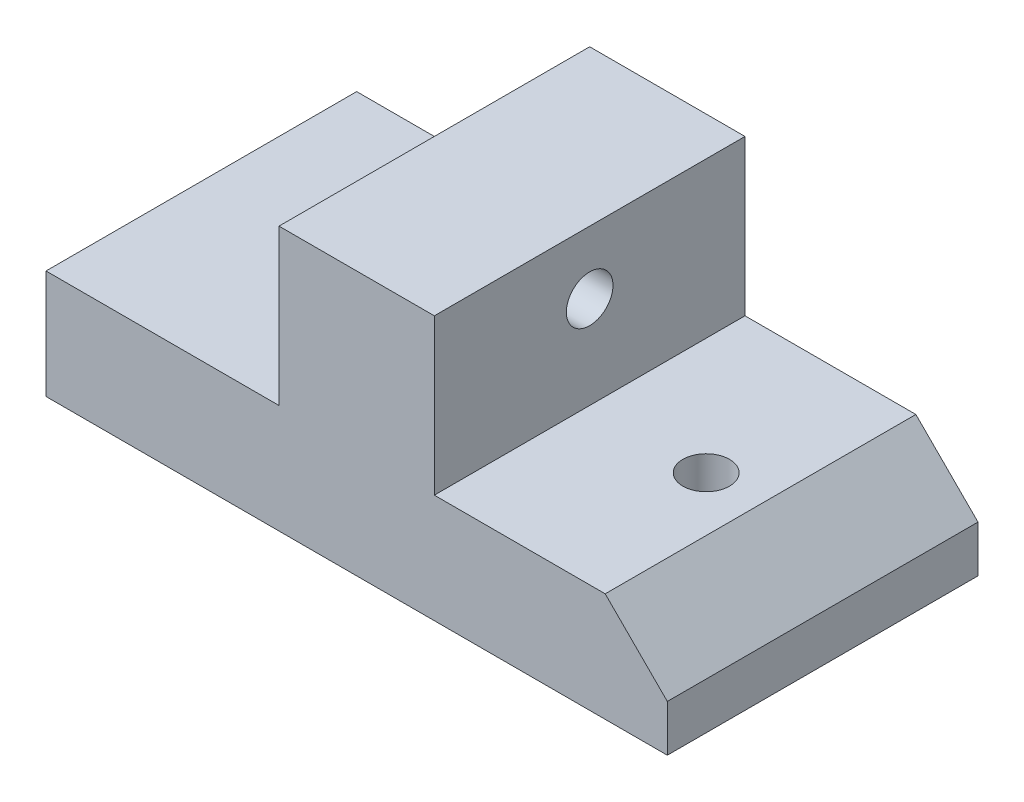
ISO-10303-21;
HEADER;
FILE_DESCRIPTION(('STEP AP214'),'2;1');
FILE_NAME('part.step','',(''),(''),'','','');
FILE_SCHEMA(('AUTOMOTIVE_DESIGN { 1 0 10303 214 1 1 1 1 }'));
ENDSEC;
DATA;
#1=APPLICATION_CONTEXT('core data for automotive mechanical design processes');
#2=APPLICATION_PROTOCOL_DEFINITION('international standard','automotive_design',2000,#1);
#3=PRODUCT_CONTEXT('',#1,'mechanical');
#4=PRODUCT('Part','Part','',(#3));
#5=PRODUCT_RELATED_PRODUCT_CATEGORY('part','',(#4));
#6=PRODUCT_DEFINITION_FORMATION('','',#4);
#7=PRODUCT_DEFINITION_CONTEXT('part definition',#1,'design');
#8=PRODUCT_DEFINITION('design','',#6,#7);
#9=PRODUCT_DEFINITION_SHAPE('','',#8);
#10=(LENGTH_UNIT() NAMED_UNIT(*) SI_UNIT(.MILLI.,.METRE.));
#11=(NAMED_UNIT(*) PLANE_ANGLE_UNIT() SI_UNIT($,.RADIAN.));
#12=(NAMED_UNIT(*) SI_UNIT($,.STERADIAN.) SOLID_ANGLE_UNIT());
#13=UNCERTAINTY_MEASURE_WITH_UNIT(LENGTH_MEASURE(1.E-05),#10,'distance_accuracy_value','');
#14=(GEOMETRIC_REPRESENTATION_CONTEXT(3) GLOBAL_UNCERTAINTY_ASSIGNED_CONTEXT((#13)) GLOBAL_UNIT_ASSIGNED_CONTEXT((#10,
#11,#12)) REPRESENTATION_CONTEXT('',''));
#15=CARTESIAN_POINT('',(0.,0.,0.));
#16=DIRECTION('',(0.,0.,1.));
#17=DIRECTION('',(1.,0.,0.));
#18=AXIS2_PLACEMENT_3D('',#15,#16,#17);
#19=CARTESIAN_POINT('',(-34.4732902548026,4.,8.91666201209773));
#20=DIRECTION('',(0.,0.,-1.));
#21=DIRECTION('',(-1.,0.,0.));
#22=AXIS2_PLACEMENT_3D('',#19,#20,#21);
#23=PLANE('',#22);
#24=DIRECTION('',(-1.,0.,0.));
#25=VECTOR('',#24,1.);
#26=CARTESIAN_POINT('',(-34.4732902548026,-3.,8.91666201209773));
#27=LINE('',#26,#25);
#28=CARTESIAN_POINT('',(5.52670974519742,-3.,8.91666201209773));
#29=VERTEX_POINT('',#28);
#30=CARTESIAN_POINT('',(-34.4732902548026,-3.,8.91666201209773));
#31=VERTEX_POINT('',#30);
#32=EDGE_CURVE('E114',#29,#31,#27,.T.);
#33=ORIENTED_EDGE('',*,*,#32,.F.);
#34=DIRECTION('',(0.,1.,0.));
#35=VECTOR('',#34,1.);
#36=CARTESIAN_POINT('',(5.52670974519742,-4.5,8.91666201209773));
#37=LINE('',#36,#35);
#38=CARTESIAN_POINT('',(5.52670974519742,0.,8.91666201209773));
#39=VERTEX_POINT('',#38);
#40=EDGE_CURVE('E204',#29,#39,#37,.T.);
#41=ORIENTED_EDGE('',*,*,#40,.T.);
#42=DIRECTION('',(-0.707106781186548,0.707106781186548,0.));
#43=VECTOR('',#42,1.);
#44=CARTESIAN_POINT('',(1.52670974519742,4.,8.91666201209773));
#45=LINE('',#44,#43);
#46=CARTESIAN_POINT('',(1.52670974519743,4.,8.91666201209773));
#47=VERTEX_POINT('',#46);
#48=EDGE_CURVE('E63',#39,#47,#45,.T.);
#49=ORIENTED_EDGE('',*,*,#48,.T.);
#50=DIRECTION('',(1.,0.,0.));
#51=VECTOR('',#50,1.);
#52=CARTESIAN_POINT('',(-34.4732902548026,4.,8.91666201209773));
#53=LINE('',#52,#51);
#54=CARTESIAN_POINT('',(-9.47329025480258,4.,8.91666201209773));
#55=VERTEX_POINT('',#54);
#56=EDGE_CURVE('E149',#55,#47,#53,.T.);
#57=ORIENTED_EDGE('',*,*,#56,.F.);
#58=DIRECTION('',(0.,-1.,0.));
#59=VECTOR('',#58,1.);
#60=CARTESIAN_POINT('',(-9.47329025480258,14.,8.91666201209773));
#61=LINE('',#60,#59);
#62=CARTESIAN_POINT('',(-9.47329025480258,14.,8.91666201209773));
#63=VERTEX_POINT('',#62);
#64=EDGE_CURVE('E143',#63,#55,#61,.T.);
#65=ORIENTED_EDGE('',*,*,#64,.F.);
#66=DIRECTION('',(1.,0.,0.));
#67=VECTOR('',#66,1.);
#68=CARTESIAN_POINT('',(-19.4732902548026,14.,8.91666201209773));
#69=LINE('',#68,#67);
#70=CARTESIAN_POINT('',(-19.4732902548026,14.,8.91666201209773));
#71=VERTEX_POINT('',#70);
#72=EDGE_CURVE('E169',#71,#63,#69,.T.);
#73=ORIENTED_EDGE('',*,*,#72,.F.);
#74=DIRECTION('',(0.,-1.,0.));
#75=VECTOR('',#74,1.);
#76=CARTESIAN_POINT('',(-19.4732902548026,14.,8.91666201209773));
#77=LINE('',#76,#75);
#78=CARTESIAN_POINT('',(-19.4732902548026,4.,8.91666201209773));
#79=VERTEX_POINT('',#78);
#80=EDGE_CURVE('E161',#71,#79,#77,.T.);
#81=ORIENTED_EDGE('',*,*,#80,.T.);
#82=CARTESIAN_POINT('',(-34.4732902548026,4.,8.91666201209773));
#83=VERTEX_POINT('',#82);
#84=EDGE_CURVE('E145',#83,#79,#53,.T.);
#85=ORIENTED_EDGE('',*,*,#84,.F.);
#86=DIRECTION('',(0.,-1.,0.));
#87=VECTOR('',#86,1.);
#88=CARTESIAN_POINT('',(-34.4732902548026,4.,8.91666201209773));
#89=LINE('',#88,#87);
#90=EDGE_CURVE('E11',#83,#31,#89,.T.);
#91=ORIENTED_EDGE('',*,*,#90,.T.);
#92=EDGE_LOOP('',(#33,#41,#49,#57,#65,#73,#81,#85,#91));
#93=FACE_BOUND('',#92,.T.);
#94=ADVANCED_FACE('F38',(#93),#23,.F.);
#95=CARTESIAN_POINT('',(-34.4732902548026,4.,-11.0833379879023));
#96=DIRECTION('',(0.,0.,1.));
#97=DIRECTION('',(1.,0.,0.));
#98=AXIS2_PLACEMENT_3D('',#95,#96,#97);
#99=PLANE('',#98);
#100=DIRECTION('',(1.,0.,0.));
#101=VECTOR('',#100,1.);
#102=CARTESIAN_POINT('',(-34.4732902548026,-3.,-11.0833379879023));
#103=LINE('',#102,#101);
#104=CARTESIAN_POINT('',(-34.4732902548026,-3.,-11.0833379879023));
#105=VERTEX_POINT('',#104);
#106=CARTESIAN_POINT('',(5.52670974519742,-3.,-11.0833379879023));
#107=VERTEX_POINT('',#106);
#108=EDGE_CURVE('E55',#105,#107,#103,.T.);
#109=ORIENTED_EDGE('',*,*,#108,.F.);
#110=DIRECTION('',(0.,-1.,0.));
#111=VECTOR('',#110,1.);
#112=CARTESIAN_POINT('',(-34.4732902548026,4.,-11.0833379879023));
#113=LINE('',#112,#111);
#114=CARTESIAN_POINT('',(-34.4732902548026,4.,-11.0833379879023));
#115=VERTEX_POINT('',#114);
#116=EDGE_CURVE('E48',#115,#105,#113,.T.);
#117=ORIENTED_EDGE('',*,*,#116,.F.);
#118=DIRECTION('',(-1.,0.,0.));
#119=VECTOR('',#118,1.);
#120=CARTESIAN_POINT('',(-34.4732902548026,4.,-11.0833379879023));
#121=LINE('',#120,#119);
#122=CARTESIAN_POINT('',(-19.4732902548026,4.,-11.0833379879023));
#123=VERTEX_POINT('',#122);
#124=EDGE_CURVE('E137',#123,#115,#121,.T.);
#125=ORIENTED_EDGE('',*,*,#124,.F.);
#126=DIRECTION('',(0.,-1.,0.));
#127=VECTOR('',#126,1.);
#128=CARTESIAN_POINT('',(-19.4732902548026,14.,-11.0833379879023));
#129=LINE('',#128,#127);
#130=CARTESIAN_POINT('',(-19.4732902548026,14.,-11.0833379879023));
#131=VERTEX_POINT('',#130);
#132=EDGE_CURVE('E158',#131,#123,#129,.T.);
#133=ORIENTED_EDGE('',*,*,#132,.F.);
#134=DIRECTION('',(1.,0.,0.));
#135=VECTOR('',#134,1.);
#136=CARTESIAN_POINT('',(-19.4732902548026,14.,-11.0833379879023));
#137=LINE('',#136,#135);
#138=CARTESIAN_POINT('',(-9.47329025480258,14.,-11.0833379879023));
#139=VERTEX_POINT('',#138);
#140=EDGE_CURVE('E176',#131,#139,#137,.T.);
#141=ORIENTED_EDGE('',*,*,#140,.T.);
#142=DIRECTION('',(0.,-1.,0.));
#143=VECTOR('',#142,1.);
#144=CARTESIAN_POINT('',(-9.47329025480258,14.,-11.0833379879023));
#145=LINE('',#144,#143);
#146=CARTESIAN_POINT('',(-9.47329025480258,4.,-11.0833379879023));
#147=VERTEX_POINT('',#146);
#148=EDGE_CURVE('E154',#139,#147,#145,.T.);
#149=ORIENTED_EDGE('',*,*,#148,.T.);
#150=CARTESIAN_POINT('',(1.52670974519742,4.,-11.0833379879023));
#151=VERTEX_POINT('',#150);
#152=EDGE_CURVE('E134',#151,#147,#121,.T.);
#153=ORIENTED_EDGE('',*,*,#152,.F.);
#154=DIRECTION('',(-0.707106781186548,0.707106781186548,0.));
#155=VECTOR('',#154,1.);
#156=CARTESIAN_POINT('',(1.52670974519742,4.,-11.0833379879023));
#157=LINE('',#156,#155);
#158=CARTESIAN_POINT('',(5.52670974519742,0.,-11.0833379879023));
#159=VERTEX_POINT('',#158);
#160=EDGE_CURVE('E201',#159,#151,#157,.T.);
#161=ORIENTED_EDGE('',*,*,#160,.F.);
#162=DIRECTION('',(0.,1.,0.));
#163=VECTOR('',#162,1.);
#164=CARTESIAN_POINT('',(5.52670974519742,-4.5,-11.0833379879023));
#165=LINE('',#164,#163);
#166=EDGE_CURVE('E127',#107,#159,#165,.T.);
#167=ORIENTED_EDGE('',*,*,#166,.F.);
#168=EDGE_LOOP('',(#109,#117,#125,#133,#141,#149,#153,#161,#167));
#169=FACE_BOUND('',#168,.T.);
#170=ADVANCED_FACE('F123',(#169),#99,.F.);
#171=CARTESIAN_POINT('',(-34.4732902548026,4.,-11.0833379879023));
#172=DIRECTION('',(1.,0.,0.));
#173=DIRECTION('',(0.,0.,-1.));
#174=AXIS2_PLACEMENT_3D('',#171,#172,#173);
#175=PLANE('',#174);
#176=DIRECTION('',(0.,0.,-1.));
#177=VECTOR('',#176,1.);
#178=CARTESIAN_POINT('',(-34.4732902548026,-3.,8.91666201209773));
#179=LINE('',#178,#177);
#180=EDGE_CURVE('E110',#31,#105,#179,.T.);
#181=ORIENTED_EDGE('',*,*,#180,.F.);
#182=ORIENTED_EDGE('',*,*,#90,.F.);
#183=DIRECTION('',(0.,0.,1.));
#184=VECTOR('',#183,1.);
#185=CARTESIAN_POINT('',(-34.4732902548026,4.,-11.0833379879023));
#186=LINE('',#185,#184);
#187=EDGE_CURVE('E132',#115,#83,#186,.T.);
#188=ORIENTED_EDGE('',*,*,#187,.F.);
#189=ORIENTED_EDGE('',*,*,#116,.T.);
#190=EDGE_LOOP('',(#181,#182,#188,#189));
#191=FACE_BOUND('',#190,.T.);
#192=ADVANCED_FACE('F40',(#191),#175,.F.);
#193=CARTESIAN_POINT('',(-26.9732902548026,-16.,-1.08333798790227));
#194=DIRECTION('',(0.,1.,0.));
#195=DIRECTION('',(0.,0.,1.));
#196=AXIS2_PLACEMENT_3D('',#193,#194,#195);
#197=CYLINDRICAL_SURFACE('',#196,1.5);
#198=CARTESIAN_POINT('',(-26.9732902548026,4.,-1.08333798790227));
#199=DIRECTION('',(0.,1.,0.));
#200=DIRECTION('',(0.,0.,1.));
#201=AXIS2_PLACEMENT_3D('',#198,#199,#200);
#202=CIRCLE('',#201,1.5);
#203=CARTESIAN_POINT('',(-26.9732902548026,4.,0.416662012097734));
#204=VERTEX_POINT('',#203);
#205=EDGE_CURVE('E191',#204,#204,#202,.T.);
#206=ORIENTED_EDGE('',*,*,#205,.T.);
#207=EDGE_LOOP('',(#206));
#208=FACE_BOUND('',#207,.T.);
#209=CARTESIAN_POINT('',(-26.9732902548026,-3.,-1.08333798790227));
#210=DIRECTION('',(0.,-1.,0.));
#211=DIRECTION('',(0.,0.,-1.));
#212=AXIS2_PLACEMENT_3D('',#209,#210,#211);
#213=CIRCLE('',#212,1.5);
#214=CARTESIAN_POINT('',(-26.9732902548026,-3.,-2.58333798790227));
#215=VERTEX_POINT('',#214);
#216=EDGE_CURVE('E212',#215,#215,#213,.F.);
#217=ORIENTED_EDGE('',*,*,#216,.F.);
#218=EDGE_LOOP('',(#217));
#219=FACE_BOUND('',#218,.T.);
#220=ADVANCED_FACE('F338',(#208,#219),#197,.F.);
#221=CARTESIAN_POINT('',(-1.97329025480258,-16.,-1.08333798790227));
#222=DIRECTION('',(0.,1.,0.));
#223=DIRECTION('',(0.,0.,1.));
#224=AXIS2_PLACEMENT_3D('',#221,#222,#223);
#225=CYLINDRICAL_SURFACE('',#224,1.5);
#226=CARTESIAN_POINT('',(-1.97329025480258,4.,-1.08333798790227));
#227=DIRECTION('',(0.,1.,0.));
#228=DIRECTION('',(0.,0.,1.));
#229=AXIS2_PLACEMENT_3D('',#226,#227,#228);
#230=CIRCLE('',#229,1.5);
#231=CARTESIAN_POINT('',(-1.97329025480258,4.,0.416662012097733));
#232=VERTEX_POINT('',#231);
#233=EDGE_CURVE('E190',#232,#232,#230,.T.);
#234=ORIENTED_EDGE('',*,*,#233,.T.);
#235=EDGE_LOOP('',(#234));
#236=FACE_BOUND('',#235,.T.);
#237=CARTESIAN_POINT('',(-1.97329025480258,-3.,-1.08333798790227));
#238=DIRECTION('',(0.,-1.,0.));
#239=DIRECTION('',(0.,0.,-1.));
#240=AXIS2_PLACEMENT_3D('',#237,#238,#239);
#241=CIRCLE('',#240,1.5);
#242=CARTESIAN_POINT('',(-1.97329025480258,-3.,-2.58333798790227));
#243=VERTEX_POINT('',#242);
#244=EDGE_CURVE('E216',#243,#243,#241,.F.);
#245=ORIENTED_EDGE('',*,*,#244,.F.);
#246=EDGE_LOOP('',(#245));
#247=FACE_BOUND('',#246,.T.);
#248=ADVANCED_FACE('F348',(#236,#247),#225,.F.);
#249=CARTESIAN_POINT('',(5.52670974519742,-4.5,8.91666201209773));
#250=DIRECTION('',(-1.,0.,0.));
#251=DIRECTION('',(0.,0.,1.));
#252=AXIS2_PLACEMENT_3D('',#249,#250,#251);
#253=PLANE('',#252);
#254=DIRECTION('',(0.,0.,1.));
#255=VECTOR('',#254,1.);
#256=CARTESIAN_POINT('',(5.52670974519742,-3.,8.91666201209773));
#257=LINE('',#256,#255);
#258=EDGE_CURVE('E129',#107,#29,#257,.T.);
#259=ORIENTED_EDGE('',*,*,#258,.F.);
#260=ORIENTED_EDGE('',*,*,#166,.T.);
#261=DIRECTION('',(0.,0.,-1.));
#262=VECTOR('',#261,1.);
#263=CARTESIAN_POINT('',(5.52670974519742,0.,-11.0833379879023));
#264=LINE('',#263,#262);
#265=EDGE_CURVE('E140',#39,#159,#264,.T.);
#266=ORIENTED_EDGE('',*,*,#265,.F.);
#267=ORIENTED_EDGE('',*,*,#40,.F.);
#268=EDGE_LOOP('',(#259,#260,#266,#267));
#269=FACE_BOUND('',#268,.T.);
#270=ADVANCED_FACE('F226',(#269),#253,.F.);
#271=CARTESIAN_POINT('',(0.,4.,0.));
#272=DIRECTION('',(0.,1.,0.));
#273=DIRECTION('',(0.,0.,1.));
#274=AXIS2_PLACEMENT_3D('',#271,#272,#273);
#275=PLANE('',#274);
#276=ORIENTED_EDGE('',*,*,#233,.F.);
#277=EDGE_LOOP('',(#276));
#278=FACE_BOUND('',#277,.T.);
#279=ORIENTED_EDGE('',*,*,#56,.T.);
#280=DIRECTION('',(0.,0.,-1.));
#281=VECTOR('',#280,1.);
#282=CARTESIAN_POINT('',(1.52670974519742,4.,92.4935345813976));
#283=LINE('',#282,#281);
#284=EDGE_CURVE('E195',#47,#151,#283,.T.);
#285=ORIENTED_EDGE('',*,*,#284,.T.);
#286=ORIENTED_EDGE('',*,*,#152,.T.);
#287=DIRECTION('',(0.,0.,1.));
#288=VECTOR('',#287,1.);
#289=CARTESIAN_POINT('',(-9.47329025480258,4.,-11.0833379879023));
#290=LINE('',#289,#288);
#291=EDGE_CURVE('E170',#147,#55,#290,.T.);
#292=ORIENTED_EDGE('',*,*,#291,.T.);
#293=EDGE_LOOP('',(#279,#285,#286,#292));
#294=FACE_BOUND('',#293,.T.);
#295=ADVANCED_FACE('F232',(#278,#294),#275,.T.);
#296=ORIENTED_EDGE('',*,*,#205,.F.);
#297=EDGE_LOOP('',(#296));
#298=FACE_BOUND('',#297,.T.);
#299=DIRECTION('',(0.,0.,1.));
#300=VECTOR('',#299,1.);
#301=CARTESIAN_POINT('',(-19.4732902548026,4.,-11.0833379879023));
#302=LINE('',#301,#300);
#303=EDGE_CURVE('E166',#123,#79,#302,.T.);
#304=ORIENTED_EDGE('',*,*,#303,.F.);
#305=ORIENTED_EDGE('',*,*,#124,.T.);
#306=ORIENTED_EDGE('',*,*,#187,.T.);
#307=ORIENTED_EDGE('',*,*,#84,.T.);
#308=EDGE_LOOP('',(#304,#305,#306,#307));
#309=FACE_BOUND('',#308,.T.);
#310=ADVANCED_FACE('F268',(#298,#309),#275,.T.);
#311=CARTESIAN_POINT('',(-9.47329025480258,14.,-11.0833379879023));
#312=DIRECTION('',(1.,0.,0.));
#313=DIRECTION('',(0.,0.,-1.));
#314=AXIS2_PLACEMENT_3D('',#311,#312,#313);
#315=PLANE('',#314);
#316=CARTESIAN_POINT('',(-9.47329025480258,9.951,-1.08333798790227));
#317=DIRECTION('',(1.,0.,0.));
#318=DIRECTION('',(0.,0.,-1.));
#319=AXIS2_PLACEMENT_3D('',#316,#317,#318);
#320=CIRCLE('',#319,1.5);
#321=CARTESIAN_POINT('',(-9.47329025480258,9.951,-2.58333798790227));
#322=VERTEX_POINT('',#321);
#323=EDGE_CURVE('E186',#322,#322,#320,.T.);
#324=ORIENTED_EDGE('',*,*,#323,.F.);
#325=EDGE_LOOP('',(#324));
#326=FACE_BOUND('',#325,.T.);
#327=ORIENTED_EDGE('',*,*,#291,.F.);
#328=ORIENTED_EDGE('',*,*,#148,.F.);
#329=DIRECTION('',(0.,0.,1.));
#330=VECTOR('',#329,1.);
#331=CARTESIAN_POINT('',(-9.47329025480258,14.,-11.0833379879023));
#332=LINE('',#331,#330);
#333=EDGE_CURVE('E180',#139,#63,#332,.T.);
#334=ORIENTED_EDGE('',*,*,#333,.T.);
#335=ORIENTED_EDGE('',*,*,#64,.T.);
#336=EDGE_LOOP('',(#327,#328,#334,#335));
#337=FACE_BOUND('',#336,.T.);
#338=ADVANCED_FACE('F237',(#326,#337),#315,.T.);
#339=CARTESIAN_POINT('',(-19.4732902548026,14.,-11.0833379879023));
#340=DIRECTION('',(1.,0.,0.));
#341=DIRECTION('',(0.,0.,-1.));
#342=AXIS2_PLACEMENT_3D('',#339,#340,#341);
#343=PLANE('',#342);
#344=CARTESIAN_POINT('',(-19.4732902548026,9.951,-1.08333798790227));
#345=DIRECTION('',(1.,0.,0.));
#346=DIRECTION('',(0.,0.,-1.));
#347=AXIS2_PLACEMENT_3D('',#344,#345,#346);
#348=CIRCLE('',#347,1.5);
#349=CARTESIAN_POINT('',(-19.4732902548026,9.951,-2.58333798790227));
#350=VERTEX_POINT('',#349);
#351=EDGE_CURVE('E42',#350,#350,#348,.T.);
#352=ORIENTED_EDGE('',*,*,#351,.T.);
#353=EDGE_LOOP('',(#352));
#354=FACE_BOUND('',#353,.T.);
#355=ORIENTED_EDGE('',*,*,#303,.T.);
#356=ORIENTED_EDGE('',*,*,#80,.F.);
#357=DIRECTION('',(0.,0.,1.));
#358=VECTOR('',#357,1.);
#359=CARTESIAN_POINT('',(-19.4732902548026,14.,-11.0833379879023));
#360=LINE('',#359,#358);
#361=EDGE_CURVE('E165',#131,#71,#360,.T.);
#362=ORIENTED_EDGE('',*,*,#361,.F.);
#363=ORIENTED_EDGE('',*,*,#132,.T.);
#364=EDGE_LOOP('',(#355,#356,#362,#363));
#365=FACE_BOUND('',#364,.T.);
#366=ADVANCED_FACE('F246',(#354,#365),#343,.F.);
#367=CARTESIAN_POINT('',(0.,14.,0.));
#368=DIRECTION('',(0.,-1.,0.));
#369=DIRECTION('',(0.,0.,-1.));
#370=AXIS2_PLACEMENT_3D('',#367,#368,#369);
#371=PLANE('',#370);
#372=ORIENTED_EDGE('',*,*,#72,.T.);
#373=ORIENTED_EDGE('',*,*,#333,.F.);
#374=ORIENTED_EDGE('',*,*,#140,.F.);
#375=ORIENTED_EDGE('',*,*,#361,.T.);
#376=EDGE_LOOP('',(#372,#373,#374,#375));
#377=FACE_BOUND('',#376,.T.);
#378=ADVANCED_FACE('F251',(#377),#371,.F.);
#379=CARTESIAN_POINT('',(-29.4732902548026,9.951,-1.08333798790227));
#380=DIRECTION('',(1.,0.,0.));
#381=DIRECTION('',(0.,0.,-1.));
#382=AXIS2_PLACEMENT_3D('',#379,#380,#381);
#383=CYLINDRICAL_SURFACE('',#382,1.5);
#384=ORIENTED_EDGE('',*,*,#323,.T.);
#385=EDGE_LOOP('',(#384));
#386=FACE_BOUND('',#385,.T.);
#387=ORIENTED_EDGE('',*,*,#351,.F.);
#388=EDGE_LOOP('',(#387));
#389=FACE_BOUND('',#388,.T.);
#390=ADVANCED_FACE('F249',(#386,#389),#383,.F.);
#391=CARTESIAN_POINT('',(1.52670974519742,4.,92.4935345813976));
#392=DIRECTION('',(0.707106781186547,0.707106781186547,0.));
#393=DIRECTION('',(-0.707106781186548,0.707106781186548,0.));
#394=AXIS2_PLACEMENT_3D('',#391,#392,#393);
#395=PLANE('',#394);
#396=ORIENTED_EDGE('',*,*,#48,.F.);
#397=ORIENTED_EDGE('',*,*,#265,.T.);
#398=ORIENTED_EDGE('',*,*,#160,.T.);
#399=ORIENTED_EDGE('',*,*,#284,.F.);
#400=EDGE_LOOP('',(#396,#397,#398,#399));
#401=FACE_BOUND('',#400,.T.);
#402=ADVANCED_FACE('F229',(#401),#395,.T.);
#403=CARTESIAN_POINT('',(0.,-3.,0.));
#404=DIRECTION('',(0.,-1.,0.));
#405=DIRECTION('',(0.,0.,-1.));
#406=AXIS2_PLACEMENT_3D('',#403,#404,#405);
#407=PLANE('',#406);
#408=ORIENTED_EDGE('',*,*,#180,.T.);
#409=ORIENTED_EDGE('',*,*,#108,.T.);
#410=ORIENTED_EDGE('',*,*,#258,.T.);
#411=ORIENTED_EDGE('',*,*,#32,.T.);
#412=EDGE_LOOP('',(#408,#409,#410,#411));
#413=FACE_BOUND('',#412,.T.);
#414=ORIENTED_EDGE('',*,*,#244,.T.);
#415=EDGE_LOOP('',(#414));
#416=FACE_BOUND('',#415,.T.);
#417=ORIENTED_EDGE('',*,*,#216,.T.);
#418=EDGE_LOOP('',(#417));
#419=FACE_BOUND('',#418,.T.);
#420=ADVANCED_FACE('F111',(#413,#416,#419),#407,.T.);
#421=CLOSED_SHELL('',(#94,#170,#192,#220,#248,#270,#295,#310,#338,#366,#378,#390,#402,#420));
#422=MANIFOLD_SOLID_BREP('B2',#421);
#423=ADVANCED_BREP_SHAPE_REPRESENTATION('',(#18,#422),#14);
#424=SHAPE_DEFINITION_REPRESENTATION(#9,#423);
ENDSEC;
END-ISO-10303-21;
